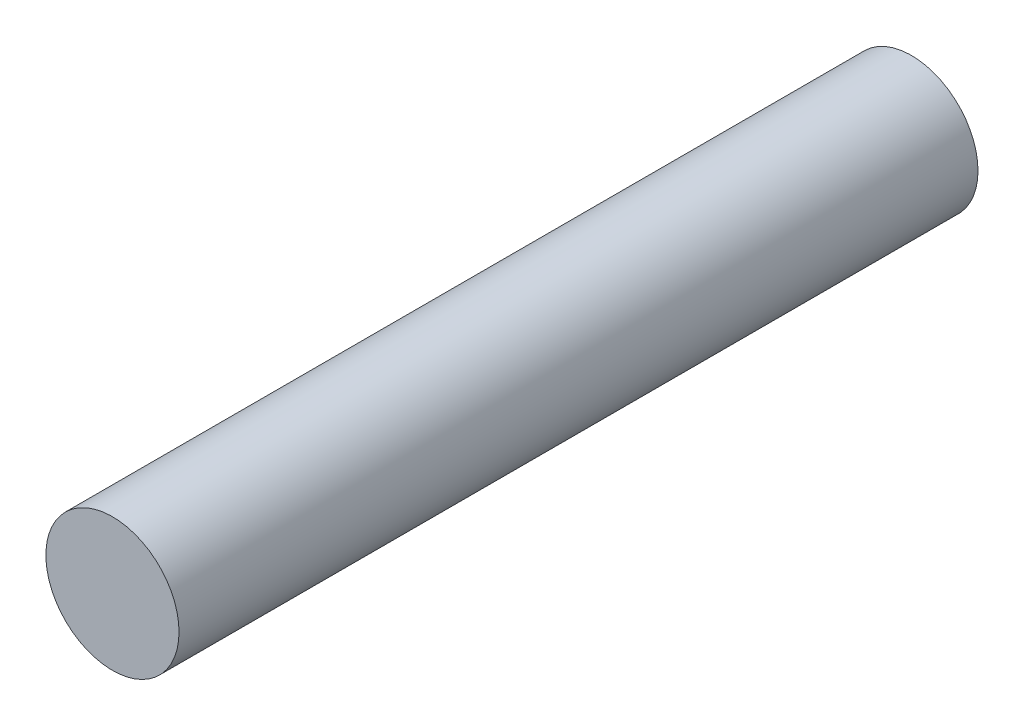
ISO-10303-21;
HEADER;
FILE_DESCRIPTION(('STEP AP214'),'2;1');
FILE_NAME('part.step','',(''),(''),'','','');
FILE_SCHEMA(('AUTOMOTIVE_DESIGN { 1 0 10303 214 1 1 1 1 }'));
ENDSEC;
DATA;
#1=APPLICATION_CONTEXT('core data for automotive mechanical design processes');
#2=APPLICATION_PROTOCOL_DEFINITION('international standard','automotive_design',2000,#1);
#3=PRODUCT_CONTEXT('',#1,'mechanical');
#4=PRODUCT('Part','Part','',(#3));
#5=PRODUCT_RELATED_PRODUCT_CATEGORY('part','',(#4));
#6=PRODUCT_DEFINITION_FORMATION('','',#4);
#7=PRODUCT_DEFINITION_CONTEXT('part definition',#1,'design');
#8=PRODUCT_DEFINITION('design','',#6,#7);
#9=PRODUCT_DEFINITION_SHAPE('','',#8);
#10=(LENGTH_UNIT() NAMED_UNIT(*) SI_UNIT(.MILLI.,.METRE.));
#11=(NAMED_UNIT(*) PLANE_ANGLE_UNIT() SI_UNIT($,.RADIAN.));
#12=(NAMED_UNIT(*) SI_UNIT($,.STERADIAN.) SOLID_ANGLE_UNIT());
#13=UNCERTAINTY_MEASURE_WITH_UNIT(LENGTH_MEASURE(1.E-05),#10,'distance_accuracy_value','');
#14=(GEOMETRIC_REPRESENTATION_CONTEXT(3) GLOBAL_UNCERTAINTY_ASSIGNED_CONTEXT((#13)) GLOBAL_UNIT_ASSIGNED_CONTEXT((#10,
#11,#12)) REPRESENTATION_CONTEXT('',''));
#15=CARTESIAN_POINT('',(0.,0.,0.));
#16=DIRECTION('',(0.,0.,1.));
#17=DIRECTION('',(1.,0.,0.));
#18=AXIS2_PLACEMENT_3D('',#15,#16,#17);
#19=CARTESIAN_POINT('',(0.,0.,6.));
#20=DIRECTION('',(0.,0.,-1.));
#21=DIRECTION('',(-1.,0.,0.));
#22=AXIS2_PLACEMENT_3D('',#19,#20,#21);
#23=CYLINDRICAL_SURFACE('',#22,0.5);
#24=CARTESIAN_POINT('',(0.,0.,6.));
#25=DIRECTION('',(0.,0.,1.));
#26=DIRECTION('',(1.,0.,0.));
#27=AXIS2_PLACEMENT_3D('',#24,#25,#26);
#28=CIRCLE('',#27,0.5);
#29=CARTESIAN_POINT('',(0.5,0.,6.));
#30=VERTEX_POINT('',#29);
#31=EDGE_CURVE('E10',#30,#30,#28,.T.);
#32=ORIENTED_EDGE('',*,*,#31,.F.);
#33=EDGE_LOOP('',(#32));
#34=FACE_BOUND('',#33,.T.);
#35=CARTESIAN_POINT('',(0.,0.,0.));
#36=DIRECTION('',(0.,0.,1.));
#37=DIRECTION('',(1.,0.,0.));
#38=AXIS2_PLACEMENT_3D('',#35,#36,#37);
#39=CIRCLE('',#38,0.5);
#40=CARTESIAN_POINT('',(0.5,0.,0.));
#41=VERTEX_POINT('',#40);
#42=EDGE_CURVE('E40',#41,#41,#39,.T.);
#43=ORIENTED_EDGE('',*,*,#42,.T.);
#44=EDGE_LOOP('',(#43));
#45=FACE_BOUND('',#44,.T.);
#46=ADVANCED_FACE('F37',(#34,#45),#23,.T.);
#47=CARTESIAN_POINT('',(0.,0.,6.));
#48=DIRECTION('',(0.,0.,1.));
#49=DIRECTION('',(1.,0.,0.));
#50=AXIS2_PLACEMENT_3D('',#47,#48,#49);
#51=PLANE('',#50);
#52=ORIENTED_EDGE('',*,*,#31,.T.);
#53=EDGE_LOOP('',(#52));
#54=FACE_BOUND('',#53,.T.);
#55=ADVANCED_FACE('F54',(#54),#51,.T.);
#56=CARTESIAN_POINT('',(0.,0.,0.));
#57=DIRECTION('',(0.,0.,1.));
#58=DIRECTION('',(1.,0.,0.));
#59=AXIS2_PLACEMENT_3D('',#56,#57,#58);
#60=PLANE('',#59);
#61=ORIENTED_EDGE('',*,*,#42,.F.);
#62=EDGE_LOOP('',(#61));
#63=FACE_BOUND('',#62,.T.);
#64=ADVANCED_FACE('F52',(#63),#60,.F.);
#65=CLOSED_SHELL('',(#46,#55,#64));
#66=MANIFOLD_SOLID_BREP('B2',#65);
#67=ADVANCED_BREP_SHAPE_REPRESENTATION('',(#18,#66),#14);
#68=SHAPE_DEFINITION_REPRESENTATION(#9,#67);
ENDSEC;
END-ISO-10303-21;
